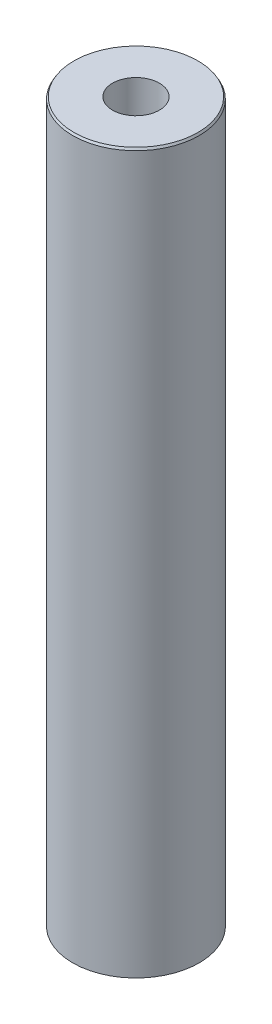
ISO-10303-21;
HEADER;
FILE_DESCRIPTION(('STEP AP214'),'2;1');
FILE_NAME('part.step','',(''),(''),'','','');
FILE_SCHEMA(('AUTOMOTIVE_DESIGN { 1 0 10303 214 1 1 1 1 }'));
ENDSEC;
DATA;
#1=APPLICATION_CONTEXT('core data for automotive mechanical design processes');
#2=APPLICATION_PROTOCOL_DEFINITION('international standard','automotive_design',2000,#1);
#3=PRODUCT_CONTEXT('',#1,'mechanical');
#4=PRODUCT('Part','Part','',(#3));
#5=PRODUCT_RELATED_PRODUCT_CATEGORY('part','',(#4));
#6=PRODUCT_DEFINITION_FORMATION('','',#4);
#7=PRODUCT_DEFINITION_CONTEXT('part definition',#1,'design');
#8=PRODUCT_DEFINITION('design','',#6,#7);
#9=PRODUCT_DEFINITION_SHAPE('','',#8);
#10=(LENGTH_UNIT() NAMED_UNIT(*) SI_UNIT(.MILLI.,.METRE.));
#11=(NAMED_UNIT(*) PLANE_ANGLE_UNIT() SI_UNIT($,.RADIAN.));
#12=(NAMED_UNIT(*) SI_UNIT($,.STERADIAN.) SOLID_ANGLE_UNIT());
#13=UNCERTAINTY_MEASURE_WITH_UNIT(LENGTH_MEASURE(1.E-05),#10,'distance_accuracy_value','');
#14=(GEOMETRIC_REPRESENTATION_CONTEXT(3) GLOBAL_UNCERTAINTY_ASSIGNED_CONTEXT((#13)) GLOBAL_UNIT_ASSIGNED_CONTEXT((#10,
#11,#12)) REPRESENTATION_CONTEXT('',''));
#15=CARTESIAN_POINT('',(0.,0.,0.));
#16=DIRECTION('',(0.,0.,1.));
#17=DIRECTION('',(1.,0.,0.));
#18=AXIS2_PLACEMENT_3D('',#15,#16,#17);
#19=CARTESIAN_POINT('',(0.,568.919930683998,0.));
#20=DIRECTION('',(0.,-1.,0.));
#21=DIRECTION('',(0.,0.,-1.));
#22=AXIS2_PLACEMENT_3D('',#19,#20,#21);
#23=CYLINDRICAL_SURFACE('',#22,50.);
#24=CARTESIAN_POINT('',(0.,567.2468621154,0.));
#25=DIRECTION('',(0.,1.,0.));
#26=DIRECTION('',(0.,0.,1.));
#27=AXIS2_PLACEMENT_3D('',#24,#25,#26);
#28=CIRCLE('',#27,50.);
#29=CARTESIAN_POINT('',(0.,567.2468621154,50.));
#30=VERTEX_POINT('',#29);
#31=EDGE_CURVE('E50',#30,#30,#28,.F.);
#32=ORIENTED_EDGE('',*,*,#31,.T.);
#33=EDGE_LOOP('',(#32));
#34=FACE_BOUND('',#33,.T.);
#35=CARTESIAN_POINT('',(0.,0.965946588453059,0.));
#36=DIRECTION('',(0.,1.,0.));
#37=DIRECTION('',(0.,0.,1.));
#38=AXIS2_PLACEMENT_3D('',#35,#36,#37);
#39=CIRCLE('',#38,50.);
#40=CARTESIAN_POINT('',(0.,0.965946588453059,50.));
#41=VERTEX_POINT('',#40);
#42=EDGE_CURVE('E51',#41,#41,#39,.T.);
#43=ORIENTED_EDGE('',*,*,#42,.T.);
#44=EDGE_LOOP('',(#43));
#45=FACE_BOUND('',#44,.T.);
#46=ADVANCED_FACE('F39',(#34,#45),#23,.T.);
#47=CARTESIAN_POINT('',(0.,568.919930683998,0.));
#48=DIRECTION('',(0.,1.,0.));
#49=DIRECTION('',(0.,0.,1.));
#50=AXIS2_PLACEMENT_3D('',#47,#48,#49);
#51=PLANE('',#50);
#52=CARTESIAN_POINT('',(0.,568.919930683998,0.));
#53=DIRECTION('',(0.,1.,0.));
#54=DIRECTION('',(0.,0.,1.));
#55=AXIS2_PLACEMENT_3D('',#52,#53,#54);
#56=CIRCLE('',#55,49.034053411547);
#57=CARTESIAN_POINT('',(0.,568.919930683998,49.034053411547));
#58=VERTEX_POINT('',#57);
#59=EDGE_CURVE('E54',#58,#58,#56,.T.);
#60=ORIENTED_EDGE('',*,*,#59,.T.);
#61=EDGE_LOOP('',(#60));
#62=FACE_BOUND('',#61,.T.);
#63=CARTESIAN_POINT('',(0.,568.919930683998,0.));
#64=DIRECTION('',(0.,1.,0.));
#65=DIRECTION('',(0.,0.,1.));
#66=AXIS2_PLACEMENT_3D('',#63,#64,#65);
#67=CIRCLE('',#66,18.5217903397011);
#68=CARTESIAN_POINT('',(0.,568.919930683998,18.5217903397011));
#69=VERTEX_POINT('',#68);
#70=EDGE_CURVE('E58',#69,#69,#67,.T.);
#71=ORIENTED_EDGE('',*,*,#70,.F.);
#72=EDGE_LOOP('',(#71));
#73=FACE_BOUND('',#72,.T.);
#74=ADVANCED_FACE('F69',(#62,#73),#51,.T.);
#75=CARTESIAN_POINT('',(0.,0.,0.));
#76=DIRECTION('',(0.,1.,0.));
#77=DIRECTION('',(0.,0.,1.));
#78=AXIS2_PLACEMENT_3D('',#75,#76,#77);
#79=PLANE('',#78);
#80=CARTESIAN_POINT('',(0.,0.,0.));
#81=DIRECTION('',(0.,1.,0.));
#82=DIRECTION('',(0.,0.,1.));
#83=AXIS2_PLACEMENT_3D('',#80,#81,#82);
#84=CIRCLE('',#83,48.3269314314014);
#85=CARTESIAN_POINT('',(0.,0.,48.3269314314014));
#86=VERTEX_POINT('',#85);
#87=EDGE_CURVE('E10',#86,#86,#84,.F.);
#88=ORIENTED_EDGE('',*,*,#87,.T.);
#89=EDGE_LOOP('',(#88));
#90=FACE_BOUND('',#89,.T.);
#91=CARTESIAN_POINT('',(0.,0.,0.));
#92=DIRECTION('',(0.,1.,0.));
#93=DIRECTION('',(0.,0.,1.));
#94=AXIS2_PLACEMENT_3D('',#91,#92,#93);
#95=CIRCLE('',#94,18.5217903397011);
#96=CARTESIAN_POINT('',(0.,0.,18.5217903397011));
#97=VERTEX_POINT('',#96);
#98=EDGE_CURVE('E63',#97,#97,#95,.T.);
#99=ORIENTED_EDGE('',*,*,#98,.T.);
#100=EDGE_LOOP('',(#99));
#101=FACE_BOUND('',#100,.T.);
#102=ADVANCED_FACE('F75',(#90,#101),#79,.F.);
#103=CARTESIAN_POINT('',(0.,568.919930683998,0.));
#104=DIRECTION('',(0.,-1.,0.));
#105=DIRECTION('',(0.,0.,-1.));
#106=AXIS2_PLACEMENT_3D('',#103,#104,#105);
#107=CYLINDRICAL_SURFACE('',#106,18.5217903397011);
#108=ORIENTED_EDGE('',*,*,#70,.T.);
#109=EDGE_LOOP('',(#108));
#110=FACE_BOUND('',#109,.T.);
#111=ORIENTED_EDGE('',*,*,#98,.F.);
#112=EDGE_LOOP('',(#111));
#113=FACE_BOUND('',#112,.T.);
#114=ADVANCED_FACE('F70',(#110,#113),#107,.F.);
#115=CARTESIAN_POINT('',(0.,568.919930683998,0.));
#116=DIRECTION('',(0.,-1.,0.));
#117=DIRECTION('',(0.,0.,-1.));
#118=AXIS2_PLACEMENT_3D('',#115,#116,#117);
#119=CONICAL_SURFACE('',#118,49.034053411547,0.52359877559829);
#120=ORIENTED_EDGE('',*,*,#31,.F.);
#121=EDGE_LOOP('',(#120));
#122=FACE_BOUND('',#121,.T.);
#123=ORIENTED_EDGE('',*,*,#59,.F.);
#124=EDGE_LOOP('',(#123));
#125=FACE_BOUND('',#124,.T.);
#126=ADVANCED_FACE('F81',(#122,#125),#119,.T.);
#127=CARTESIAN_POINT('',(0.,0.965946588453059,0.));
#128=DIRECTION('',(0.,1.,0.));
#129=DIRECTION('',(0.,0.,1.));
#130=AXIS2_PLACEMENT_3D('',#127,#128,#129);
#131=CONICAL_SURFACE('',#130,50.,1.04719755119661);
#132=ORIENTED_EDGE('',*,*,#87,.F.);
#133=EDGE_LOOP('',(#132));
#134=FACE_BOUND('',#133,.T.);
#135=ORIENTED_EDGE('',*,*,#42,.F.);
#136=EDGE_LOOP('',(#135));
#137=FACE_BOUND('',#136,.T.);
#138=ADVANCED_FACE('F45',(#134,#137),#131,.T.);
#139=CLOSED_SHELL('',(#46,#74,#102,#114,#126,#138));
#140=MANIFOLD_SOLID_BREP('B2',#139);
#141=ADVANCED_BREP_SHAPE_REPRESENTATION('',(#18,#140),#14);
#142=SHAPE_DEFINITION_REPRESENTATION(#9,#141);
ENDSEC;
END-ISO-10303-21;
